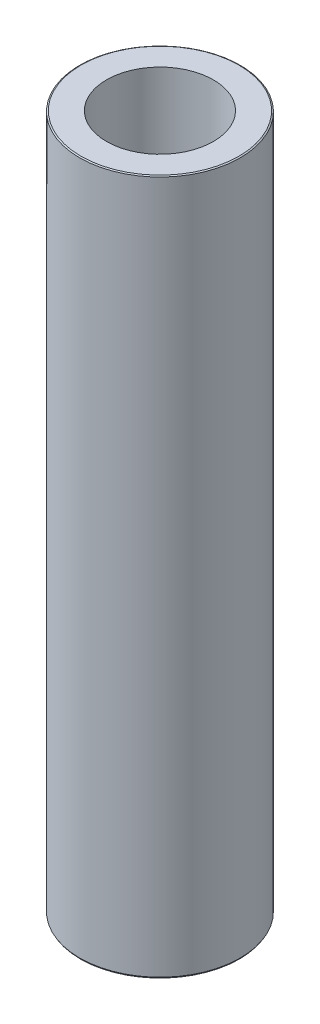
ISO-10303-21;
HEADER;
FILE_DESCRIPTION(('STEP AP214'),'2;1');
FILE_NAME('part.step','',(''),(''),'','','');
FILE_SCHEMA(('AUTOMOTIVE_DESIGN { 1 0 10303 214 1 1 1 1 }'));
ENDSEC;
DATA;
#1=APPLICATION_CONTEXT('core data for automotive mechanical design processes');
#2=APPLICATION_PROTOCOL_DEFINITION('international standard','automotive_design',2000,#1);
#3=PRODUCT_CONTEXT('',#1,'mechanical');
#4=PRODUCT('Part','Part','',(#3));
#5=PRODUCT_RELATED_PRODUCT_CATEGORY('part','',(#4));
#6=PRODUCT_DEFINITION_FORMATION('','',#4);
#7=PRODUCT_DEFINITION_CONTEXT('part definition',#1,'design');
#8=PRODUCT_DEFINITION('design','',#6,#7);
#9=PRODUCT_DEFINITION_SHAPE('','',#8);
#10=(LENGTH_UNIT() NAMED_UNIT(*) SI_UNIT(.MILLI.,.METRE.));
#11=(NAMED_UNIT(*) PLANE_ANGLE_UNIT() SI_UNIT($,.RADIAN.));
#12=(NAMED_UNIT(*) SI_UNIT($,.STERADIAN.) SOLID_ANGLE_UNIT());
#13=UNCERTAINTY_MEASURE_WITH_UNIT(LENGTH_MEASURE(1.E-05),#10,'distance_accuracy_value','');
#14=(GEOMETRIC_REPRESENTATION_CONTEXT(3) GLOBAL_UNCERTAINTY_ASSIGNED_CONTEXT((#13)) GLOBAL_UNIT_ASSIGNED_CONTEXT((#10,
#11,#12)) REPRESENTATION_CONTEXT('',''));
#15=CARTESIAN_POINT('',(0.,0.,0.));
#16=DIRECTION('',(0.,0.,1.));
#17=DIRECTION('',(1.,0.,0.));
#18=AXIS2_PLACEMENT_3D('',#15,#16,#17);
#19=CARTESIAN_POINT('',(0.,194.857915599093,0.));
#20=DIRECTION('',(0.,-1.,0.));
#21=DIRECTION('',(0.,0.,-1.));
#22=AXIS2_PLACEMENT_3D('',#19,#20,#21);
#23=CYLINDRICAL_SURFACE('',#22,22.5);
#24=CARTESIAN_POINT('',(0.,194.649781052239,0.));
#25=DIRECTION('',(0.,1.,0.));
#26=DIRECTION('',(0.,0.,1.));
#27=AXIS2_PLACEMENT_3D('',#24,#25,#26);
#28=CIRCLE('',#27,22.5);
#29=CARTESIAN_POINT('',(0.,194.649781052239,22.5));
#30=VERTEX_POINT('',#29);
#31=EDGE_CURVE('E50',#30,#30,#28,.F.);
#32=ORIENTED_EDGE('',*,*,#31,.T.);
#33=EDGE_LOOP('',(#32));
#34=FACE_BOUND('',#33,.T.);
#35=CARTESIAN_POINT('',(0.,0.360499609961012,0.));
#36=DIRECTION('',(0.,1.,0.));
#37=DIRECTION('',(0.,0.,1.));
#38=AXIS2_PLACEMENT_3D('',#35,#36,#37);
#39=CIRCLE('',#38,22.5);
#40=CARTESIAN_POINT('',(0.,0.360499609961012,22.5));
#41=VERTEX_POINT('',#40);
#42=EDGE_CURVE('E51',#41,#41,#39,.T.);
#43=ORIENTED_EDGE('',*,*,#42,.T.);
#44=EDGE_LOOP('',(#43));
#45=FACE_BOUND('',#44,.T.);
#46=ADVANCED_FACE('F39',(#34,#45),#23,.T.);
#47=CARTESIAN_POINT('',(0.,194.857915599093,0.));
#48=DIRECTION('',(0.,1.,0.));
#49=DIRECTION('',(0.,0.,1.));
#50=AXIS2_PLACEMENT_3D('',#47,#48,#49);
#51=PLANE('',#50);
#52=CARTESIAN_POINT('',(0.,194.857915599093,0.));
#53=DIRECTION('',(0.,1.,0.));
#54=DIRECTION('',(0.,0.,1.));
#55=AXIS2_PLACEMENT_3D('',#52,#53,#54);
#56=CIRCLE('',#55,22.1395003900391);
#57=CARTESIAN_POINT('',(0.,194.857915599093,22.1395003900391));
#58=VERTEX_POINT('',#57);
#59=EDGE_CURVE('E54',#58,#58,#56,.T.);
#60=ORIENTED_EDGE('',*,*,#59,.T.);
#61=EDGE_LOOP('',(#60));
#62=FACE_BOUND('',#61,.T.);
#63=CARTESIAN_POINT('',(0.,194.857915599093,0.));
#64=DIRECTION('',(0.,1.,0.));
#65=DIRECTION('',(0.,0.,1.));
#66=AXIS2_PLACEMENT_3D('',#63,#64,#65);
#67=CIRCLE('',#66,14.9880952318459);
#68=CARTESIAN_POINT('',(0.,194.857915599093,14.9880952318459));
#69=VERTEX_POINT('',#68);
#70=EDGE_CURVE('E58',#69,#69,#67,.T.);
#71=ORIENTED_EDGE('',*,*,#70,.F.);
#72=EDGE_LOOP('',(#71));
#73=FACE_BOUND('',#72,.T.);
#74=ADVANCED_FACE('F69',(#62,#73),#51,.T.);
#75=CARTESIAN_POINT('',(0.,0.,0.));
#76=DIRECTION('',(0.,1.,0.));
#77=DIRECTION('',(0.,0.,1.));
#78=AXIS2_PLACEMENT_3D('',#75,#76,#77);
#79=PLANE('',#78);
#80=CARTESIAN_POINT('',(0.,0.,0.));
#81=DIRECTION('',(0.,1.,0.));
#82=DIRECTION('',(0.,0.,1.));
#83=AXIS2_PLACEMENT_3D('',#80,#81,#82);
#84=CIRCLE('',#83,22.2918654531463);
#85=CARTESIAN_POINT('',(0.,0.,22.2918654531463));
#86=VERTEX_POINT('',#85);
#87=EDGE_CURVE('E10',#86,#86,#84,.F.);
#88=ORIENTED_EDGE('',*,*,#87,.T.);
#89=EDGE_LOOP('',(#88));
#90=FACE_BOUND('',#89,.T.);
#91=CARTESIAN_POINT('',(0.,0.,0.));
#92=DIRECTION('',(0.,1.,0.));
#93=DIRECTION('',(0.,0.,1.));
#94=AXIS2_PLACEMENT_3D('',#91,#92,#93);
#95=CIRCLE('',#94,14.9880952318459);
#96=CARTESIAN_POINT('',(0.,0.,14.9880952318459));
#97=VERTEX_POINT('',#96);
#98=EDGE_CURVE('E63',#97,#97,#95,.T.);
#99=ORIENTED_EDGE('',*,*,#98,.T.);
#100=EDGE_LOOP('',(#99));
#101=FACE_BOUND('',#100,.T.);
#102=ADVANCED_FACE('F75',(#90,#101),#79,.F.);
#103=CARTESIAN_POINT('',(0.,194.857915599093,0.));
#104=DIRECTION('',(0.,-1.,0.));
#105=DIRECTION('',(0.,0.,-1.));
#106=AXIS2_PLACEMENT_3D('',#103,#104,#105);
#107=CYLINDRICAL_SURFACE('',#106,14.9880952318459);
#108=ORIENTED_EDGE('',*,*,#70,.T.);
#109=EDGE_LOOP('',(#108));
#110=FACE_BOUND('',#109,.T.);
#111=ORIENTED_EDGE('',*,*,#98,.F.);
#112=EDGE_LOOP('',(#111));
#113=FACE_BOUND('',#112,.T.);
#114=ADVANCED_FACE('F70',(#110,#113),#107,.F.);
#115=CARTESIAN_POINT('',(0.,194.857915599093,0.));
#116=DIRECTION('',(0.,-1.,0.));
#117=DIRECTION('',(0.,0.,-1.));
#118=AXIS2_PLACEMENT_3D('',#115,#116,#117);
#119=CONICAL_SURFACE('',#118,22.1395003900391,1.0471975511966);
#120=ORIENTED_EDGE('',*,*,#31,.F.);
#121=EDGE_LOOP('',(#120));
#122=FACE_BOUND('',#121,.T.);
#123=ORIENTED_EDGE('',*,*,#59,.F.);
#124=EDGE_LOOP('',(#123));
#125=FACE_BOUND('',#124,.T.);
#126=ADVANCED_FACE('F81',(#122,#125),#119,.T.);
#127=CARTESIAN_POINT('',(0.,0.360499609961012,0.));
#128=DIRECTION('',(0.,1.,0.));
#129=DIRECTION('',(0.,0.,1.));
#130=AXIS2_PLACEMENT_3D('',#127,#128,#129);
#131=CONICAL_SURFACE('',#130,22.5,0.523598775598254);
#132=ORIENTED_EDGE('',*,*,#87,.F.);
#133=EDGE_LOOP('',(#132));
#134=FACE_BOUND('',#133,.T.);
#135=ORIENTED_EDGE('',*,*,#42,.F.);
#136=EDGE_LOOP('',(#135));
#137=FACE_BOUND('',#136,.T.);
#138=ADVANCED_FACE('F45',(#134,#137),#131,.T.);
#139=CLOSED_SHELL('',(#46,#74,#102,#114,#126,#138));
#140=MANIFOLD_SOLID_BREP('B2',#139);
#141=ADVANCED_BREP_SHAPE_REPRESENTATION('',(#18,#140),#14);
#142=SHAPE_DEFINITION_REPRESENTATION(#9,#141);
ENDSEC;
END-ISO-10303-21;
